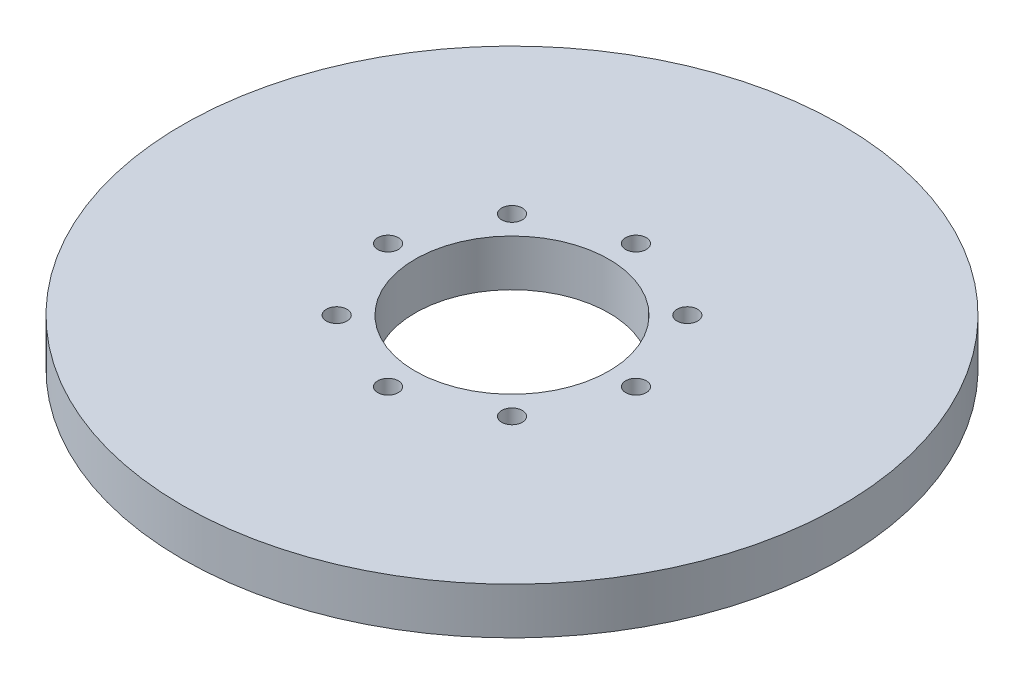
ISO-10303-21;
HEADER;
FILE_DESCRIPTION(('STEP AP214'),'2;1');
FILE_NAME('part.step','',(''),(''),'','','');
FILE_SCHEMA(('AUTOMOTIVE_DESIGN { 1 0 10303 214 1 1 1 1 }'));
ENDSEC;
DATA;
#1=APPLICATION_CONTEXT('core data for automotive mechanical design processes');
#2=APPLICATION_PROTOCOL_DEFINITION('international standard','automotive_design',2000,#1);
#3=PRODUCT_CONTEXT('',#1,'mechanical');
#4=PRODUCT('Part','Part','',(#3));
#5=PRODUCT_RELATED_PRODUCT_CATEGORY('part','',(#4));
#6=PRODUCT_DEFINITION_FORMATION('','',#4);
#7=PRODUCT_DEFINITION_CONTEXT('part definition',#1,'design');
#8=PRODUCT_DEFINITION('design','',#6,#7);
#9=PRODUCT_DEFINITION_SHAPE('','',#8);
#10=(LENGTH_UNIT() NAMED_UNIT(*) SI_UNIT(.MILLI.,.METRE.));
#11=(NAMED_UNIT(*) PLANE_ANGLE_UNIT() SI_UNIT($,.RADIAN.));
#12=(NAMED_UNIT(*) SI_UNIT($,.STERADIAN.) SOLID_ANGLE_UNIT());
#13=UNCERTAINTY_MEASURE_WITH_UNIT(LENGTH_MEASURE(1.E-05),#10,'distance_accuracy_value','');
#14=(GEOMETRIC_REPRESENTATION_CONTEXT(3) GLOBAL_UNCERTAINTY_ASSIGNED_CONTEXT((#13)) GLOBAL_UNIT_ASSIGNED_CONTEXT((#10,
#11,#12)) REPRESENTATION_CONTEXT('',''));
#15=CARTESIAN_POINT('',(0.,0.,0.));
#16=DIRECTION('',(0.,0.,1.));
#17=DIRECTION('',(1.,0.,0.));
#18=AXIS2_PLACEMENT_3D('',#15,#16,#17);
#19=CARTESIAN_POINT('',(0.,12.,0.));
#20=DIRECTION('',(0.,-1.,0.));
#21=DIRECTION('',(0.,0.,-1.));
#22=AXIS2_PLACEMENT_3D('',#19,#20,#21);
#23=CYLINDRICAL_SURFACE('',#22,85.);
#24=CARTESIAN_POINT('',(0.,12.,0.));
#25=DIRECTION('',(0.,1.,0.));
#26=DIRECTION('',(0.,0.,1.));
#27=AXIS2_PLACEMENT_3D('',#24,#25,#26);
#28=CIRCLE('',#27,85.);
#29=CARTESIAN_POINT('',(0.,12.,85.));
#30=VERTEX_POINT('',#29);
#31=EDGE_CURVE('E10',#30,#30,#28,.T.);
#32=ORIENTED_EDGE('',*,*,#31,.F.);
#33=EDGE_LOOP('',(#32));
#34=FACE_BOUND('',#33,.T.);
#35=CARTESIAN_POINT('',(0.,0.,0.));
#36=DIRECTION('',(0.,1.,0.));
#37=DIRECTION('',(0.,0.,1.));
#38=AXIS2_PLACEMENT_3D('',#35,#36,#37);
#39=CIRCLE('',#38,85.);
#40=CARTESIAN_POINT('',(0.,0.,85.));
#41=VERTEX_POINT('',#40);
#42=EDGE_CURVE('E37',#41,#41,#39,.T.);
#43=ORIENTED_EDGE('',*,*,#42,.T.);
#44=EDGE_LOOP('',(#43));
#45=FACE_BOUND('',#44,.T.);
#46=ADVANCED_FACE('F40',(#34,#45),#23,.T.);
#47=CARTESIAN_POINT('',(0.,12.,0.));
#48=DIRECTION('',(0.,1.,0.));
#49=DIRECTION('',(0.,0.,1.));
#50=AXIS2_PLACEMENT_3D('',#47,#48,#49);
#51=PLANE('',#50);
#52=CARTESIAN_POINT('',(1.11635343689825E-13,12.,31.9736332106001));
#53=DIRECTION('',(0.,1.,0.));
#54=DIRECTION('',(1.,0.,0.));
#55=AXIS2_PLACEMENT_3D('',#52,#53,#54);
#56=CIRCLE('',#55,2.66128107750601);
#57=CARTESIAN_POINT('',(2.66128107750612,12.,31.9736332106001));
#58=VERTEX_POINT('',#57);
#59=EDGE_CURVE('E88',#58,#58,#56,.T.);
#60=ORIENTED_EDGE('',*,*,#59,.F.);
#61=EDGE_LOOP('',(#60));
#62=FACE_BOUND('',#61,.T.);
#63=CARTESIAN_POINT('',(22.6087728623869,12.,22.6087728623867));
#64=DIRECTION('',(0.,1.,0.));
#65=DIRECTION('',(0.707106781186544,0.,-0.707106781186551));
#66=AXIS2_PLACEMENT_3D('',#63,#64,#65);
#67=CIRCLE('',#66,2.66128107750601);
#68=CARTESIAN_POINT('',(24.4905827589348,12.,20.7269629658387));
#69=VERTEX_POINT('',#68);
#70=EDGE_CURVE('E79',#69,#69,#67,.T.);
#71=ORIENTED_EDGE('',*,*,#70,.F.);
#72=EDGE_LOOP('',(#71));
#73=FACE_BOUND('',#72,.T.);
#74=CARTESIAN_POINT('',(31.9736332106001,12.,0.));
#75=DIRECTION('',(0.,1.,0.));
#76=DIRECTION('',(0.,0.,-1.));
#77=AXIS2_PLACEMENT_3D('',#74,#75,#76);
#78=CIRCLE('',#77,2.66128107750601);
#79=CARTESIAN_POINT('',(31.9736332106001,12.,-2.66128107750601));
#80=VERTEX_POINT('',#79);
#81=EDGE_CURVE('E74',#80,#80,#78,.T.);
#82=ORIENTED_EDGE('',*,*,#81,.F.);
#83=EDGE_LOOP('',(#82));
#84=FACE_BOUND('',#83,.T.);
#85=CARTESIAN_POINT('',(22.6087728623866,12.,-22.608772862387));
#86=DIRECTION('',(0.,1.,0.));
#87=DIRECTION('',(-0.707106781186554,0.,-0.707106781186541));
#88=AXIS2_PLACEMENT_3D('',#85,#86,#87);
#89=CIRCLE('',#88,2.66128107750601);
#90=CARTESIAN_POINT('',(20.7269629658386,12.,-24.4905827589349));
#91=VERTEX_POINT('',#90);
#92=EDGE_CURVE('E70',#91,#91,#89,.T.);
#93=ORIENTED_EDGE('',*,*,#92,.F.);
#94=EDGE_LOOP('',(#93));
#95=FACE_BOUND('',#94,.T.);
#96=CARTESIAN_POINT('',(-3.34906031069476E-13,12.,-31.9736332106001));
#97=DIRECTION('',(0.,1.,0.));
#98=DIRECTION('',(-1.,0.,0.));
#99=AXIS2_PLACEMENT_3D('',#96,#97,#98);
#100=CIRCLE('',#99,2.66128107750601);
#101=CARTESIAN_POINT('',(-2.66128107750635,12.,-31.9736332106001));
#102=VERTEX_POINT('',#101);
#103=EDGE_CURVE('E100',#102,#102,#100,.T.);
#104=ORIENTED_EDGE('',*,*,#103,.F.);
#105=EDGE_LOOP('',(#104));
#106=FACE_BOUND('',#105,.T.);
#107=CARTESIAN_POINT('',(-22.608772862387,12.,-22.6087728623865));
#108=DIRECTION('',(0.,1.,0.));
#109=DIRECTION('',(-0.707106781186539,0.,0.707106781186556));
#110=AXIS2_PLACEMENT_3D('',#107,#108,#109);
#111=CIRCLE('',#110,2.66128107750601);
#112=CARTESIAN_POINT('',(-24.490582758935,12.,-20.7269629658385));
#113=VERTEX_POINT('',#112);
#114=EDGE_CURVE('E93',#113,#113,#111,.T.);
#115=ORIENTED_EDGE('',*,*,#114,.F.);
#116=EDGE_LOOP('',(#115));
#117=FACE_BOUND('',#116,.T.);
#118=CARTESIAN_POINT('',(-22.6087728623867,12.,22.6087728623868));
#119=DIRECTION('',(0.,1.,0.));
#120=DIRECTION('',(0.707106781186549,0.,0.707106781186546));
#121=AXIS2_PLACEMENT_3D('',#118,#119,#120);
#122=CIRCLE('',#121,2.66128107750601);
#123=CARTESIAN_POINT('',(-20.7269629658388,12.,24.4905827589347));
#124=VERTEX_POINT('',#123);
#125=EDGE_CURVE('E61',#124,#124,#122,.T.);
#126=ORIENTED_EDGE('',*,*,#125,.F.);
#127=EDGE_LOOP('',(#126));
#128=FACE_BOUND('',#127,.T.);
#129=CARTESIAN_POINT('',(-31.9736332106001,12.,0.));
#130=DIRECTION('',(0.,1.,0.));
#131=DIRECTION('',(0.,0.,1.));
#132=AXIS2_PLACEMENT_3D('',#129,#130,#131);
#133=CIRCLE('',#132,2.66128107750601);
#134=CARTESIAN_POINT('',(-31.9736332106001,12.,2.66128107750601));
#135=VERTEX_POINT('',#134);
#136=EDGE_CURVE('E54',#135,#135,#133,.T.);
#137=ORIENTED_EDGE('',*,*,#136,.F.);
#138=EDGE_LOOP('',(#137));
#139=FACE_BOUND('',#138,.T.);
#140=CARTESIAN_POINT('',(0.,12.,0.));
#141=DIRECTION('',(0.,1.,0.));
#142=DIRECTION('',(0.,0.,1.));
#143=AXIS2_PLACEMENT_3D('',#140,#141,#142);
#144=CIRCLE('',#143,25.);
#145=CARTESIAN_POINT('',(0.,12.,25.));
#146=VERTEX_POINT('',#145);
#147=EDGE_CURVE('E50',#146,#146,#144,.T.);
#148=ORIENTED_EDGE('',*,*,#147,.F.);
#149=EDGE_LOOP('',(#148));
#150=FACE_BOUND('',#149,.T.);
#151=ORIENTED_EDGE('',*,*,#31,.T.);
#152=EDGE_LOOP('',(#151));
#153=FACE_BOUND('',#152,.T.);
#154=ADVANCED_FACE('F115',(#62,#73,#84,#95,#106,#117,#128,#139,#150,#153),#51,.T.);
#155=CARTESIAN_POINT('',(0.,0.,0.));
#156=DIRECTION('',(0.,1.,0.));
#157=DIRECTION('',(0.,0.,1.));
#158=AXIS2_PLACEMENT_3D('',#155,#156,#157);
#159=PLANE('',#158);
#160=CARTESIAN_POINT('',(0.,0.,0.));
#161=DIRECTION('',(0.,1.,0.));
#162=DIRECTION('',(0.,0.,1.));
#163=AXIS2_PLACEMENT_3D('',#160,#161,#162);
#164=CIRCLE('',#163,25.);
#165=CARTESIAN_POINT('',(0.,0.,25.));
#166=VERTEX_POINT('',#165);
#167=EDGE_CURVE('E47',#166,#166,#164,.T.);
#168=ORIENTED_EDGE('',*,*,#167,.T.);
#169=EDGE_LOOP('',(#168));
#170=FACE_BOUND('',#169,.T.);
#171=ORIENTED_EDGE('',*,*,#42,.F.);
#172=EDGE_LOOP('',(#171));
#173=FACE_BOUND('',#172,.T.);
#174=ADVANCED_FACE('F113',(#170,#173),#159,.F.);
#175=CARTESIAN_POINT('',(0.,12.,0.));
#176=DIRECTION('',(0.,-1.,0.));
#177=DIRECTION('',(0.,0.,-1.));
#178=AXIS2_PLACEMENT_3D('',#175,#176,#177);
#179=CYLINDRICAL_SURFACE('',#178,25.);
#180=ORIENTED_EDGE('',*,*,#147,.T.);
#181=EDGE_LOOP('',(#180));
#182=FACE_BOUND('',#181,.T.);
#183=ORIENTED_EDGE('',*,*,#167,.F.);
#184=EDGE_LOOP('',(#183));
#185=FACE_BOUND('',#184,.T.);
#186=ADVANCED_FACE('F127',(#182,#185),#179,.F.);
#187=CARTESIAN_POINT('',(-31.9736332106001,0.269109500204716,0.));
#188=DIRECTION('',(0.,1.,0.));
#189=DIRECTION('',(0.,0.,1.));
#190=AXIS2_PLACEMENT_3D('',#187,#188,#189);
#191=CYLINDRICAL_SURFACE('',#190,2.66128107750601);
#192=CARTESIAN_POINT('',(-31.9736332106001,0.269109500204716,0.));
#193=DIRECTION('',(0.,1.,0.));
#194=DIRECTION('',(0.,0.,1.));
#195=AXIS2_PLACEMENT_3D('',#192,#193,#194);
#196=CIRCLE('',#195,2.66128107750601);
#197=CARTESIAN_POINT('',(-31.9736332106001,0.269109500204716,2.66128107750601));
#198=VERTEX_POINT('',#197);
#199=EDGE_CURVE('E55',#198,#198,#196,.T.);
#200=ORIENTED_EDGE('',*,*,#199,.F.);
#201=EDGE_LOOP('',(#200));
#202=FACE_BOUND('',#201,.T.);
#203=ORIENTED_EDGE('',*,*,#136,.T.);
#204=EDGE_LOOP('',(#203));
#205=FACE_BOUND('',#204,.T.);
#206=ADVANCED_FACE('F129',(#202,#205),#191,.F.);
#207=CARTESIAN_POINT('',(-31.9736332106001,0.269109500204716,0.));
#208=DIRECTION('',(0.,1.,0.));
#209=DIRECTION('',(0.,0.,1.));
#210=AXIS2_PLACEMENT_3D('',#207,#208,#209);
#211=PLANE('',#210);
#212=ORIENTED_EDGE('',*,*,#199,.T.);
#213=EDGE_LOOP('',(#212));
#214=FACE_BOUND('',#213,.T.);
#215=ADVANCED_FACE('F157',(#214),#211,.T.);
#216=CARTESIAN_POINT('',(-22.6087728623867,0.269109500204716,22.6087728623868));
#217=DIRECTION('',(0.,1.,0.));
#218=DIRECTION('',(0.,0.,1.));
#219=AXIS2_PLACEMENT_3D('',#216,#217,#218);
#220=CYLINDRICAL_SURFACE('',#219,2.66128107750601);
#221=CARTESIAN_POINT('',(-22.6087728623867,0.269109500204716,22.6087728623868));
#222=DIRECTION('',(0.,1.,0.));
#223=DIRECTION('',(0.707106781186549,0.,0.707106781186546));
#224=AXIS2_PLACEMENT_3D('',#221,#222,#223);
#225=CIRCLE('',#224,2.66128107750601);
#226=CARTESIAN_POINT('',(-20.7269629658388,0.269109500204716,24.4905827589347));
#227=VERTEX_POINT('',#226);
#228=EDGE_CURVE('E59',#227,#227,#225,.T.);
#229=ORIENTED_EDGE('',*,*,#228,.F.);
#230=EDGE_LOOP('',(#229));
#231=FACE_BOUND('',#230,.T.);
#232=ORIENTED_EDGE('',*,*,#125,.T.);
#233=EDGE_LOOP('',(#232));
#234=FACE_BOUND('',#233,.T.);
#235=ADVANCED_FACE('F170',(#231,#234),#220,.F.);
#236=CARTESIAN_POINT('',(-22.6087728623867,0.269109500204716,22.6087728623868));
#237=DIRECTION('',(0.,1.,0.));
#238=DIRECTION('',(0.707106781186549,0.,0.707106781186546));
#239=AXIS2_PLACEMENT_3D('',#236,#237,#238);
#240=PLANE('',#239);
#241=ORIENTED_EDGE('',*,*,#228,.T.);
#242=EDGE_LOOP('',(#241));
#243=FACE_BOUND('',#242,.T.);
#244=ADVANCED_FACE('F182',(#243),#240,.T.);
#245=CARTESIAN_POINT('',(-22.608772862387,0.269109500204716,-22.6087728623865));
#246=DIRECTION('',(0.,1.,0.));
#247=DIRECTION('',(0.,0.,1.));
#248=AXIS2_PLACEMENT_3D('',#245,#246,#247);
#249=CYLINDRICAL_SURFACE('',#248,2.66128107750601);
#250=CARTESIAN_POINT('',(-22.608772862387,0.269109500204716,-22.6087728623865));
#251=DIRECTION('',(0.,1.,0.));
#252=DIRECTION('',(-0.707106781186539,0.,0.707106781186556));
#253=AXIS2_PLACEMENT_3D('',#250,#251,#252);
#254=CIRCLE('',#253,2.66128107750601);
#255=CARTESIAN_POINT('',(-24.490582758935,0.269109500204716,-20.7269629658385));
#256=VERTEX_POINT('',#255);
#257=EDGE_CURVE('E94',#256,#256,#254,.T.);
#258=ORIENTED_EDGE('',*,*,#257,.F.);
#259=EDGE_LOOP('',(#258));
#260=FACE_BOUND('',#259,.T.);
#261=ORIENTED_EDGE('',*,*,#114,.T.);
#262=EDGE_LOOP('',(#261));
#263=FACE_BOUND('',#262,.T.);
#264=ADVANCED_FACE('F189',(#260,#263),#249,.F.);
#265=CARTESIAN_POINT('',(-22.608772862387,0.269109500204716,-22.6087728623865));
#266=DIRECTION('',(0.,1.,0.));
#267=DIRECTION('',(-0.707106781186539,0.,0.707106781186556));
#268=AXIS2_PLACEMENT_3D('',#265,#266,#267);
#269=PLANE('',#268);
#270=ORIENTED_EDGE('',*,*,#257,.T.);
#271=EDGE_LOOP('',(#270));
#272=FACE_BOUND('',#271,.T.);
#273=ADVANCED_FACE('F107',(#272),#269,.T.);
#274=CARTESIAN_POINT('',(-3.34906031069476E-13,0.269109500204716,-31.9736332106001));
#275=DIRECTION('',(0.,1.,0.));
#276=DIRECTION('',(0.,0.,1.));
#277=AXIS2_PLACEMENT_3D('',#274,#275,#276);
#278=CYLINDRICAL_SURFACE('',#277,2.66128107750601);
#279=CARTESIAN_POINT('',(-3.34906031069476E-13,0.269109500204716,-31.9736332106001));
#280=DIRECTION('',(0.,1.,0.));
#281=DIRECTION('',(-1.,0.,0.));
#282=AXIS2_PLACEMENT_3D('',#279,#280,#281);
#283=CIRCLE('',#282,2.66128107750601);
#284=CARTESIAN_POINT('',(-2.66128107750635,0.269109500204716,-31.9736332106001));
#285=VERTEX_POINT('',#284);
#286=EDGE_CURVE('E72',#285,#285,#283,.T.);
#287=ORIENTED_EDGE('',*,*,#286,.F.);
#288=EDGE_LOOP('',(#287));
#289=FACE_BOUND('',#288,.T.);
#290=ORIENTED_EDGE('',*,*,#103,.T.);
#291=EDGE_LOOP('',(#290));
#292=FACE_BOUND('',#291,.T.);
#293=ADVANCED_FACE('F104',(#289,#292),#278,.F.);
#294=CARTESIAN_POINT('',(-3.34906031069476E-13,0.269109500204716,-31.9736332106001));
#295=DIRECTION('',(0.,1.,0.));
#296=DIRECTION('',(-1.,0.,0.));
#297=AXIS2_PLACEMENT_3D('',#294,#295,#296);
#298=PLANE('',#297);
#299=ORIENTED_EDGE('',*,*,#286,.T.);
#300=EDGE_LOOP('',(#299));
#301=FACE_BOUND('',#300,.T.);
#302=ADVANCED_FACE('F103',(#301),#298,.T.);
#303=CARTESIAN_POINT('',(22.6087728623866,0.269109500204716,-22.608772862387));
#304=DIRECTION('',(0.,1.,0.));
#305=DIRECTION('',(0.,0.,1.));
#306=AXIS2_PLACEMENT_3D('',#303,#304,#305);
#307=CYLINDRICAL_SURFACE('',#306,2.66128107750601);
#308=CARTESIAN_POINT('',(22.6087728623866,0.269109500204716,-22.608772862387));
#309=DIRECTION('',(0.,1.,0.));
#310=DIRECTION('',(-0.707106781186554,0.,-0.707106781186541));
#311=AXIS2_PLACEMENT_3D('',#308,#309,#310);
#312=CIRCLE('',#311,2.66128107750601);
#313=CARTESIAN_POINT('',(20.7269629658386,0.269109500204716,-24.4905827589349));
#314=VERTEX_POINT('',#313);
#315=EDGE_CURVE('E69',#314,#314,#312,.T.);
#316=ORIENTED_EDGE('',*,*,#315,.F.);
#317=EDGE_LOOP('',(#316));
#318=FACE_BOUND('',#317,.T.);
#319=ORIENTED_EDGE('',*,*,#92,.T.);
#320=EDGE_LOOP('',(#319));
#321=FACE_BOUND('',#320,.T.);
#322=ADVANCED_FACE('F219',(#318,#321),#307,.F.);
#323=CARTESIAN_POINT('',(22.6087728623866,0.269109500204716,-22.608772862387));
#324=DIRECTION('',(0.,1.,0.));
#325=DIRECTION('',(-0.707106781186554,0.,-0.707106781186541));
#326=AXIS2_PLACEMENT_3D('',#323,#324,#325);
#327=PLANE('',#326);
#328=ORIENTED_EDGE('',*,*,#315,.T.);
#329=EDGE_LOOP('',(#328));
#330=FACE_BOUND('',#329,.T.);
#331=ADVANCED_FACE('F227',(#330),#327,.T.);
#332=CARTESIAN_POINT('',(31.9736332106001,0.269109500204716,0.));
#333=DIRECTION('',(0.,1.,0.));
#334=DIRECTION('',(0.,0.,1.));
#335=AXIS2_PLACEMENT_3D('',#332,#333,#334);
#336=CYLINDRICAL_SURFACE('',#335,2.66128107750601);
#337=CARTESIAN_POINT('',(31.9736332106001,0.269109500204716,0.));
#338=DIRECTION('',(0.,1.,0.));
#339=DIRECTION('',(0.,0.,-1.));
#340=AXIS2_PLACEMENT_3D('',#337,#338,#339);
#341=CIRCLE('',#340,2.66128107750601);
#342=CARTESIAN_POINT('',(31.9736332106001,0.269109500204716,-2.66128107750601));
#343=VERTEX_POINT('',#342);
#344=EDGE_CURVE('E80',#343,#343,#341,.T.);
#345=ORIENTED_EDGE('',*,*,#344,.F.);
#346=EDGE_LOOP('',(#345));
#347=FACE_BOUND('',#346,.T.);
#348=ORIENTED_EDGE('',*,*,#81,.T.);
#349=EDGE_LOOP('',(#348));
#350=FACE_BOUND('',#349,.T.);
#351=ADVANCED_FACE('F240',(#347,#350),#336,.F.);
#352=CARTESIAN_POINT('',(31.9736332106001,0.269109500204716,0.));
#353=DIRECTION('',(0.,1.,0.));
#354=DIRECTION('',(0.,0.,-1.));
#355=AXIS2_PLACEMENT_3D('',#352,#353,#354);
#356=PLANE('',#355);
#357=ORIENTED_EDGE('',*,*,#344,.T.);
#358=EDGE_LOOP('',(#357));
#359=FACE_BOUND('',#358,.T.);
#360=ADVANCED_FACE('F246',(#359),#356,.T.);
#361=CARTESIAN_POINT('',(22.6087728623869,0.269109500204716,22.6087728623867));
#362=DIRECTION('',(0.,1.,0.));
#363=DIRECTION('',(0.,0.,1.));
#364=AXIS2_PLACEMENT_3D('',#361,#362,#363);
#365=CYLINDRICAL_SURFACE('',#364,2.66128107750601);
#366=CARTESIAN_POINT('',(22.6087728623869,0.269109500204716,22.6087728623867));
#367=DIRECTION('',(0.,1.,0.));
#368=DIRECTION('',(0.707106781186544,0.,-0.707106781186551));
#369=AXIS2_PLACEMENT_3D('',#366,#367,#368);
#370=CIRCLE('',#369,2.66128107750601);
#371=CARTESIAN_POINT('',(24.4905827589348,0.269109500204716,20.7269629658387));
#372=VERTEX_POINT('',#371);
#373=EDGE_CURVE('E82',#372,#372,#370,.T.);
#374=ORIENTED_EDGE('',*,*,#373,.F.);
#375=EDGE_LOOP('',(#374));
#376=FACE_BOUND('',#375,.T.);
#377=ORIENTED_EDGE('',*,*,#70,.T.);
#378=EDGE_LOOP('',(#377));
#379=FACE_BOUND('',#378,.T.);
#380=ADVANCED_FACE('F254',(#376,#379),#365,.F.);
#381=CARTESIAN_POINT('',(22.6087728623869,0.269109500204716,22.6087728623867));
#382=DIRECTION('',(0.,1.,0.));
#383=DIRECTION('',(0.707106781186544,0.,-0.707106781186551));
#384=AXIS2_PLACEMENT_3D('',#381,#382,#383);
#385=PLANE('',#384);
#386=ORIENTED_EDGE('',*,*,#373,.T.);
#387=EDGE_LOOP('',(#386));
#388=FACE_BOUND('',#387,.T.);
#389=ADVANCED_FACE('F262',(#388),#385,.T.);
#390=CARTESIAN_POINT('',(1.11635343689825E-13,0.269109500204716,31.9736332106001));
#391=DIRECTION('',(0.,1.,0.));
#392=DIRECTION('',(0.,0.,1.));
#393=AXIS2_PLACEMENT_3D('',#390,#391,#392);
#394=CYLINDRICAL_SURFACE('',#393,2.66128107750601);
#395=CARTESIAN_POINT('',(1.11635343689825E-13,0.269109500204716,31.9736332106001));
#396=DIRECTION('',(0.,1.,0.));
#397=DIRECTION('',(1.,0.,0.));
#398=AXIS2_PLACEMENT_3D('',#395,#396,#397);
#399=CIRCLE('',#398,2.66128107750601);
#400=CARTESIAN_POINT('',(2.66128107750612,0.269109500204716,31.9736332106001));
#401=VERTEX_POINT('',#400);
#402=EDGE_CURVE('E63',#401,#401,#399,.T.);
#403=ORIENTED_EDGE('',*,*,#402,.F.);
#404=EDGE_LOOP('',(#403));
#405=FACE_BOUND('',#404,.T.);
#406=ORIENTED_EDGE('',*,*,#59,.T.);
#407=EDGE_LOOP('',(#406));
#408=FACE_BOUND('',#407,.T.);
#409=ADVANCED_FACE('F272',(#405,#408),#394,.F.);
#410=CARTESIAN_POINT('',(1.11635343689825E-13,0.269109500204716,31.9736332106001));
#411=DIRECTION('',(0.,1.,0.));
#412=DIRECTION('',(1.,0.,0.));
#413=AXIS2_PLACEMENT_3D('',#410,#411,#412);
#414=PLANE('',#413);
#415=ORIENTED_EDGE('',*,*,#402,.T.);
#416=EDGE_LOOP('',(#415));
#417=FACE_BOUND('',#416,.T.);
#418=ADVANCED_FACE('F285',(#417),#414,.T.);
#419=CLOSED_SHELL('',(#46,#154,#174,#186,#206,#215,#235,#244,#264,#273,#293,#302,#322,#331,#351,
#360,#380,#389,#409,#418));
#420=MANIFOLD_SOLID_BREP('B2',#419);
#421=ADVANCED_BREP_SHAPE_REPRESENTATION('',(#18,#420),#14);
#422=SHAPE_DEFINITION_REPRESENTATION(#9,#421);
ENDSEC;
END-ISO-10303-21;
